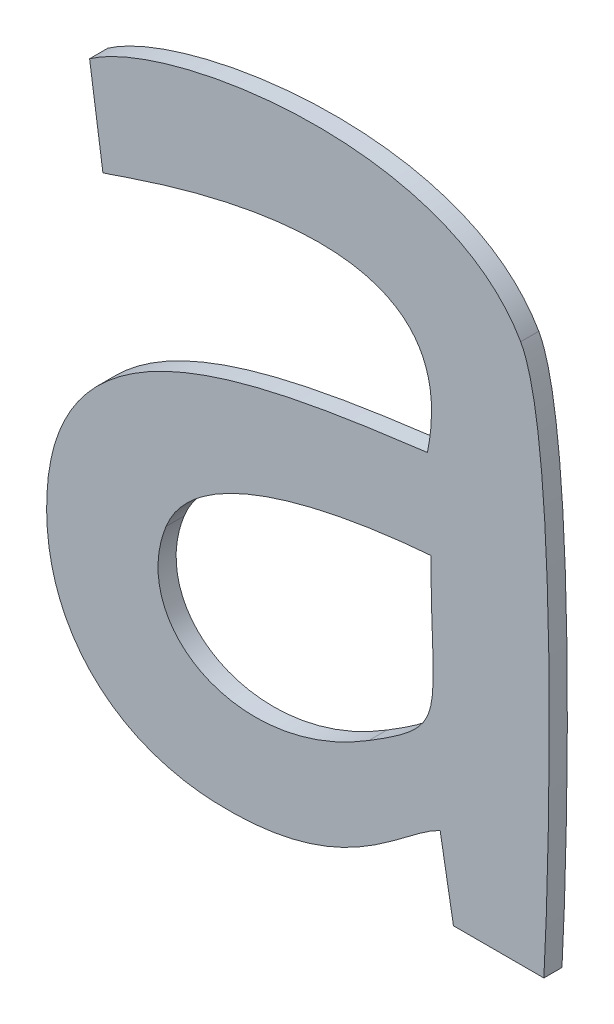
ISO-10303-21;
HEADER;
FILE_DESCRIPTION(('STEP AP214'),'2;1');
FILE_NAME('part.step','',(''),(''),'','','');
FILE_SCHEMA(('AUTOMOTIVE_DESIGN { 1 0 10303 214 1 1 1 1 }'));
ENDSEC;
DATA;
#1=APPLICATION_CONTEXT('core data for automotive mechanical design processes');
#2=APPLICATION_PROTOCOL_DEFINITION('international standard','automotive_design',2000,#1);
#3=PRODUCT_CONTEXT('',#1,'mechanical');
#4=PRODUCT('Part','Part','',(#3));
#5=PRODUCT_RELATED_PRODUCT_CATEGORY('part','',(#4));
#6=PRODUCT_DEFINITION_FORMATION('','',#4);
#7=PRODUCT_DEFINITION_CONTEXT('part definition',#1,'design');
#8=PRODUCT_DEFINITION('design','',#6,#7);
#9=PRODUCT_DEFINITION_SHAPE('','',#8);
#10=(LENGTH_UNIT() NAMED_UNIT(*) SI_UNIT(.MILLI.,.METRE.));
#11=(NAMED_UNIT(*) PLANE_ANGLE_UNIT() SI_UNIT($,.RADIAN.));
#12=(NAMED_UNIT(*) SI_UNIT($,.STERADIAN.) SOLID_ANGLE_UNIT());
#13=UNCERTAINTY_MEASURE_WITH_UNIT(LENGTH_MEASURE(1.E-05),#10,'distance_accuracy_value','');
#14=(GEOMETRIC_REPRESENTATION_CONTEXT(3) GLOBAL_UNCERTAINTY_ASSIGNED_CONTEXT((#13)) GLOBAL_UNIT_ASSIGNED_CONTEXT((#10,
#11,#12)) REPRESENTATION_CONTEXT('',''));
#15=CARTESIAN_POINT('',(0.,0.,0.));
#16=DIRECTION('',(0.,0.,1.));
#17=DIRECTION('',(1.,0.,0.));
#18=AXIS2_PLACEMENT_3D('',#15,#16,#17);
#19=CARTESIAN_POINT('',(-1.9011050390625,-48.580969296875,0.001));
#20=CARTESIAN_POINT('',(-1.9011050390625,-48.580969296875,0.));
#21=CARTESIAN_POINT('',(-1.9007851171875,-48.57540265625,0.001));
#22=CARTESIAN_POINT('',(-1.9007851171875,-48.57540265625,0.));
#23=CARTESIAN_POINT('',(-1.9002732421875,-48.5548956640625,0.001));
#24=CARTESIAN_POINT('',(-1.9002732421875,-48.5548956640625,0.));
#25=CARTESIAN_POINT('',(-1.9023847265625,-48.5511845703125,0.001));
#26=CARTESIAN_POINT('',(-1.9023847265625,-48.5511845703125,0.));
#27=B_SPLINE_SURFACE_WITH_KNOTS('',3,1,((#19,#20),(#21,#22),(#23,#24),(#25,#26)),.UNSPECIFIED.,
.F.,.F.,.F.,(4,4),(2,2),(0.6,0.7),(0.,1.),.UNSPECIFIED.);
#28=CARTESIAN_POINT('',(-1.9011050390625,-48.580969296875,0.));
#29=CARTESIAN_POINT('',(-1.9007851171875,-48.57540265625,0.));
#30=CARTESIAN_POINT('',(-1.9002732421875,-48.5548956640625,0.));
#31=CARTESIAN_POINT('',(-1.9023847265625,-48.5511845703125,0.));
#32=B_SPLINE_CURVE_WITH_KNOTS('',3,(#28,#29,#30,#31),.UNSPECIFIED.,.F.,.F.,(4,4),(0.6,0.7),.UNSPECIFIED.);
#33=CARTESIAN_POINT('',(-1.9011050390625,-48.580969296875,0.));
#34=VERTEX_POINT('',#33);
#35=CARTESIAN_POINT('',(-1.9023847265625,-48.5511845703125,0.));
#36=VERTEX_POINT('',#35);
#37=EDGE_CURVE('E11',#34,#36,#32,.T.);
#38=DIRECTION('',(0.,0.,-1.));
#39=VECTOR('',#38,1.);
#40=CARTESIAN_POINT('',(-1.9023847265625,-48.5511845703125,0.001));
#41=LINE('',#40,#39);
#42=CARTESIAN_POINT('',(-1.9023847265625,-48.5511845703125,0.001));
#43=VERTEX_POINT('',#42);
#44=EDGE_CURVE('E28',#43,#36,#41,.T.);
#45=CARTESIAN_POINT('',(-1.9011050390625,-48.580969296875,0.001));
#46=CARTESIAN_POINT('',(-1.9007851171875,-48.57540265625,0.001));
#47=CARTESIAN_POINT('',(-1.9002732421875,-48.5548956640625,0.001));
#48=CARTESIAN_POINT('',(-1.9023847265625,-48.5511845703125,0.001));
#49=B_SPLINE_CURVE_WITH_KNOTS('',3,(#45,#46,#47,#48),.UNSPECIFIED.,.F.,.F.,(4,4),(0.6,0.7),.UNSPECIFIED.);
#50=CARTESIAN_POINT('',(-1.9011050390625,-48.580969296875,0.001));
#51=VERTEX_POINT('',#50);
#52=EDGE_CURVE('E279',#51,#43,#49,.T.);
#53=DIRECTION('',(0.,0.,-1.));
#54=VECTOR('',#53,1.);
#55=CARTESIAN_POINT('',(-1.9011050390625,-48.580969296875,0.001));
#56=LINE('',#55,#54);
#57=EDGE_CURVE('E40',#51,#34,#56,.T.);
#58=ORIENTED_EDGE('',*,*,#37,.T.);
#59=ORIENTED_EDGE('',*,*,#44,.F.);
#60=ORIENTED_EDGE('',*,*,#52,.F.);
#61=ORIENTED_EDGE('',*,*,#57,.T.);
#62=EDGE_LOOP('',(#58,#59,#60,#61));
#63=FACE_BOUND('',#62,.T.);
#64=ADVANCED_FACE('F17',(#63),#27,.F.);
#65=CARTESIAN_POINT('',(-1.9023847265625,-48.5511845703125,0.001));
#66=CARTESIAN_POINT('',(-1.9023847265625,-48.5511845703125,0.));
#67=CARTESIAN_POINT('',(-1.906447734375,-48.5440503125,0.001));
#68=CARTESIAN_POINT('',(-1.906447734375,-48.5440503125,0.));
#69=CARTESIAN_POINT('',(-1.921676015625,-48.54635375,0.001));
#70=CARTESIAN_POINT('',(-1.921676015625,-48.54635375,0.));
#71=CARTESIAN_POINT('',(-1.9261869140625,-48.54955296875,0.001));
#72=CARTESIAN_POINT('',(-1.9261869140625,-48.54955296875,0.));
#73=B_SPLINE_SURFACE_WITH_KNOTS('',3,1,((#65,#66),(#67,#68),(#69,#70),(#71,#72)),.UNSPECIFIED.,
.F.,.F.,.F.,(4,4),(2,2),(0.7,0.8),(0.,1.),.UNSPECIFIED.);
#74=CARTESIAN_POINT('',(-1.9023847265625,-48.5511845703125,0.));
#75=CARTESIAN_POINT('',(-1.906447734375,-48.5440503125,0.));
#76=CARTESIAN_POINT('',(-1.921676015625,-48.54635375,0.));
#77=CARTESIAN_POINT('',(-1.9261869140625,-48.54955296875,0.));
#78=B_SPLINE_CURVE_WITH_KNOTS('',3,(#74,#75,#76,#77),.UNSPECIFIED.,.F.,.F.,(4,4),(0.7,0.8),.UNSPECIFIED.);
#79=CARTESIAN_POINT('',(-1.9261869140625,-48.54955296875,0.));
#80=VERTEX_POINT('',#79);
#81=EDGE_CURVE('E271',#36,#80,#78,.T.);
#82=DIRECTION('',(0.,0.,-1.));
#83=VECTOR('',#82,1.);
#84=CARTESIAN_POINT('',(-1.9261869140625,-48.54955296875,0.001));
#85=LINE('',#84,#83);
#86=CARTESIAN_POINT('',(-1.9261869140625,-48.54955296875,0.001));
#87=VERTEX_POINT('',#86);
#88=EDGE_CURVE('E266',#87,#80,#85,.T.);
#89=CARTESIAN_POINT('',(-1.9023847265625,-48.5511845703125,0.001));
#90=CARTESIAN_POINT('',(-1.906447734375,-48.5440503125,0.001));
#91=CARTESIAN_POINT('',(-1.921676015625,-48.54635375,0.001));
#92=CARTESIAN_POINT('',(-1.9261869140625,-48.54955296875,0.001));
#93=B_SPLINE_CURVE_WITH_KNOTS('',3,(#89,#90,#91,#92),.UNSPECIFIED.,.F.,.F.,(4,4),(0.7,0.8),.UNSPECIFIED.);
#94=EDGE_CURVE('E262',#43,#87,#93,.T.);
#95=ORIENTED_EDGE('',*,*,#81,.T.);
#96=ORIENTED_EDGE('',*,*,#88,.F.);
#97=ORIENTED_EDGE('',*,*,#94,.F.);
#98=ORIENTED_EDGE('',*,*,#44,.T.);
#99=EDGE_LOOP('',(#95,#96,#97,#98));
#100=FACE_BOUND('',#99,.T.);
#101=ADVANCED_FACE('F289',(#100),#73,.F.);
#102=CARTESIAN_POINT('',(-8.7656585269564,-1.2679883403744,0.001));
#103=DIRECTION('',(0.98969897857415,0.143164003189641,0.));
#104=DIRECTION('',(-0.143164003189641,0.98969897857415,0.));
#105=AXIS2_PLACEMENT_3D('',#102,#103,#104);
#106=PLANE('',#105);
#107=DIRECTION('',(0.143164003189641,-0.98969897857415,0.));
#108=VECTOR('',#107,1.);
#109=CARTESIAN_POINT('',(-8.7656585269564,-1.2679883403744,0.));
#110=LINE('',#109,#108);
#111=CARTESIAN_POINT('',(-1.92545109375,-48.5546397265625,0.));
#112=VERTEX_POINT('',#111);
#113=EDGE_CURVE('E260',#80,#112,#110,.T.);
#114=ORIENTED_EDGE('',*,*,#113,.T.);
#115=DIRECTION('',(0.,0.,-1.));
#116=VECTOR('',#115,1.);
#117=CARTESIAN_POINT('',(-1.92545109375,-48.5546397265625,0.001));
#118=LINE('',#117,#116);
#119=CARTESIAN_POINT('',(-1.92545109375,-48.5546397265625,0.001));
#120=VERTEX_POINT('',#119);
#121=EDGE_CURVE('E257',#120,#112,#118,.T.);
#122=ORIENTED_EDGE('',*,*,#121,.F.);
#123=DIRECTION('',(0.143164003189641,-0.98969897857415,0.));
#124=VECTOR('',#123,1.);
#125=CARTESIAN_POINT('',(-8.7656585269564,-1.2679883403744,0.001));
#126=LINE('',#125,#124);
#127=EDGE_CURVE('E251',#87,#120,#126,.T.);
#128=ORIENTED_EDGE('',*,*,#127,.F.);
#129=ORIENTED_EDGE('',*,*,#88,.T.);
#130=EDGE_LOOP('',(#114,#122,#128,#129));
#131=FACE_BOUND('',#130,.T.);
#132=ADVANCED_FACE('F293',(#131),#106,.F.);
#133=CARTESIAN_POINT('',(-1.92545109375,-48.5546397265625,0.001));
#134=CARTESIAN_POINT('',(-1.92545109375,-48.5546397265625,0.));
#135=CARTESIAN_POINT('',(-1.9245233203125,-48.5544477734375,0.001));
#136=CARTESIAN_POINT('',(-1.9245233203125,-48.5544477734375,0.));
#137=CARTESIAN_POINT('',(-1.90497609375,-48.546545703125,0.001));
#138=CARTESIAN_POINT('',(-1.90497609375,-48.546545703125,0.));
#139=CARTESIAN_POINT('',(-1.90753546875,-48.5590546484375,0.001));
#140=CARTESIAN_POINT('',(-1.90753546875,-48.5590546484375,0.));
#141=B_SPLINE_SURFACE_WITH_KNOTS('',3,1,((#133,#134),(#135,#136),(#137,#138),(#139,#140)),
.UNSPECIFIED.,.F.,.F.,.F.,(4,4),(2,2),(0.,0.1),(0.,1.),.UNSPECIFIED.);
#142=CARTESIAN_POINT('',(-1.92545109375,-48.5546397265625,0.));
#143=CARTESIAN_POINT('',(-1.9245233203125,-48.5544477734375,0.));
#144=CARTESIAN_POINT('',(-1.90497609375,-48.546545703125,0.));
#145=CARTESIAN_POINT('',(-1.90753546875,-48.5590546484375,0.));
#146=B_SPLINE_CURVE_WITH_KNOTS('',3,(#142,#143,#144,#145),.UNSPECIFIED.,.F.,.F.,(4,4),(0.,0.1),.UNSPECIFIED.);
#147=CARTESIAN_POINT('',(-1.90753546875,-48.5590546484375,0.));
#148=VERTEX_POINT('',#147);
#149=EDGE_CURVE('E246',#112,#148,#146,.T.);
#150=DIRECTION('',(0.,0.,-1.));
#151=VECTOR('',#150,1.);
#152=CARTESIAN_POINT('',(-1.90753546875,-48.5590546484375,0.001));
#153=LINE('',#152,#151);
#154=CARTESIAN_POINT('',(-1.90753546875,-48.5590546484375,0.001));
#155=VERTEX_POINT('',#154);
#156=EDGE_CURVE('E241',#155,#148,#153,.T.);
#157=CARTESIAN_POINT('',(-1.92545109375,-48.5546397265625,0.001));
#158=CARTESIAN_POINT('',(-1.9245233203125,-48.5544477734375,0.001));
#159=CARTESIAN_POINT('',(-1.90497609375,-48.546545703125,0.001));
#160=CARTESIAN_POINT('',(-1.90753546875,-48.5590546484375,0.001));
#161=B_SPLINE_CURVE_WITH_KNOTS('',3,(#157,#158,#159,#160),.UNSPECIFIED.,.F.,.F.,(4,4),(0.,0.1),.UNSPECIFIED.);
#162=EDGE_CURVE('E234',#120,#155,#161,.T.);
#163=ORIENTED_EDGE('',*,*,#149,.T.);
#164=ORIENTED_EDGE('',*,*,#156,.F.);
#165=ORIENTED_EDGE('',*,*,#162,.F.);
#166=ORIENTED_EDGE('',*,*,#121,.T.);
#167=EDGE_LOOP('',(#163,#164,#165,#166));
#168=FACE_BOUND('',#167,.T.);
#169=ADVANCED_FACE('F297',(#168),#141,.F.);
#170=CARTESIAN_POINT('',(-1.90753546875,-48.5590546484375,0.001));
#171=CARTESIAN_POINT('',(-1.90753546875,-48.5590546484375,0.));
#172=CARTESIAN_POINT('',(-1.9174850390625,-48.5603343359375,0.001));
#173=CARTESIAN_POINT('',(-1.9174850390625,-48.5603343359375,0.));
#174=CARTESIAN_POINT('',(-1.92929015625,-48.5620619140625,0.001));
#175=CARTESIAN_POINT('',(-1.92929015625,-48.5620619140625,0.));
#176=CARTESIAN_POINT('',(-1.92852234375,-48.5731951953125,0.001));
#177=CARTESIAN_POINT('',(-1.92852234375,-48.5731951953125,0.));
#178=B_SPLINE_SURFACE_WITH_KNOTS('',3,1,((#170,#171),(#172,#173),(#174,#175),(#176,#177)),
.UNSPECIFIED.,.F.,.F.,.F.,(4,4),(2,2),(0.1,0.2),(0.,1.),.UNSPECIFIED.);
#179=CARTESIAN_POINT('',(-1.90753546875,-48.5590546484375,0.));
#180=CARTESIAN_POINT('',(-1.9174850390625,-48.5603343359375,0.));
#181=CARTESIAN_POINT('',(-1.92929015625,-48.5620619140625,0.));
#182=CARTESIAN_POINT('',(-1.92852234375,-48.5731951953125,0.));
#183=B_SPLINE_CURVE_WITH_KNOTS('',3,(#179,#180,#181,#182),.UNSPECIFIED.,.F.,.F.,(4,4),(0.1,0.2),.UNSPECIFIED.);
#184=CARTESIAN_POINT('',(-1.92852234375,-48.5731951953125,0.));
#185=VERTEX_POINT('',#184);
#186=EDGE_CURVE('E229',#148,#185,#183,.T.);
#187=DIRECTION('',(0.,0.,-1.));
#188=VECTOR('',#187,1.);
#189=CARTESIAN_POINT('',(-1.92852234375,-48.5731951953125,0.001));
#190=LINE('',#189,#188);
#191=CARTESIAN_POINT('',(-1.92852234375,-48.5731951953125,0.001));
#192=VERTEX_POINT('',#191);
#193=EDGE_CURVE('E224',#192,#185,#190,.T.);
#194=CARTESIAN_POINT('',(-1.90753546875,-48.5590546484375,0.001));
#195=CARTESIAN_POINT('',(-1.9174850390625,-48.5603343359375,0.001));
#196=CARTESIAN_POINT('',(-1.92929015625,-48.5620619140625,0.001));
#197=CARTESIAN_POINT('',(-1.92852234375,-48.5731951953125,0.001));
#198=B_SPLINE_CURVE_WITH_KNOTS('',3,(#194,#195,#196,#197),.UNSPECIFIED.,.F.,.F.,(4,4),(0.1,0.2),.UNSPECIFIED.);
#199=EDGE_CURVE('E217',#155,#192,#198,.T.);
#200=ORIENTED_EDGE('',*,*,#186,.T.);
#201=ORIENTED_EDGE('',*,*,#193,.F.);
#202=ORIENTED_EDGE('',*,*,#199,.F.);
#203=ORIENTED_EDGE('',*,*,#156,.T.);
#204=EDGE_LOOP('',(#200,#201,#202,#203));
#205=FACE_BOUND('',#204,.T.);
#206=ADVANCED_FACE('F303',(#205),#178,.F.);
#207=CARTESIAN_POINT('',(-1.92852234375,-48.5731951953125,0.001));
#208=CARTESIAN_POINT('',(-1.92852234375,-48.5731951953125,0.));
#209=CARTESIAN_POINT('',(-1.9281384375,-48.5783139453125,0.001));
#210=CARTESIAN_POINT('',(-1.9281384375,-48.5783139453125,0.));
#211=CARTESIAN_POINT('',(-1.9244593359375,-48.5814171875,0.001));
#212=CARTESIAN_POINT('',(-1.9244593359375,-48.5814171875,0.));
#213=CARTESIAN_POINT('',(-1.91930859375,-48.5816411328125,0.001));
#214=CARTESIAN_POINT('',(-1.91930859375,-48.5816411328125,0.));
#215=B_SPLINE_SURFACE_WITH_KNOTS('',3,1,((#207,#208),(#209,#210),(#211,#212),(#213,#214)),
.UNSPECIFIED.,.F.,.F.,.F.,(4,4),(2,2),(0.2,0.3),(0.,1.),.UNSPECIFIED.);
#216=CARTESIAN_POINT('',(-1.92852234375,-48.5731951953125,0.));
#217=CARTESIAN_POINT('',(-1.9281384375,-48.5783139453125,0.));
#218=CARTESIAN_POINT('',(-1.9244593359375,-48.5814171875,0.));
#219=CARTESIAN_POINT('',(-1.91930859375,-48.5816411328125,0.));
#220=B_SPLINE_CURVE_WITH_KNOTS('',3,(#216,#217,#218,#219),.UNSPECIFIED.,.F.,.F.,(4,4),(0.2,0.3),.UNSPECIFIED.);
#221=CARTESIAN_POINT('',(-1.91930859375,-48.5816411328125,0.));
#222=VERTEX_POINT('',#221);
#223=EDGE_CURVE('E212',#185,#222,#220,.T.);
#224=DIRECTION('',(0.,0.,-1.));
#225=VECTOR('',#224,1.);
#226=CARTESIAN_POINT('',(-1.91930859375,-48.5816411328125,0.001));
#227=LINE('',#226,#225);
#228=CARTESIAN_POINT('',(-1.91930859375,-48.5816411328125,0.001));
#229=VERTEX_POINT('',#228);
#230=EDGE_CURVE('E207',#229,#222,#227,.T.);
#231=CARTESIAN_POINT('',(-1.92852234375,-48.5731951953125,0.001));
#232=CARTESIAN_POINT('',(-1.9281384375,-48.5783139453125,0.001));
#233=CARTESIAN_POINT('',(-1.9244593359375,-48.5814171875,0.001));
#234=CARTESIAN_POINT('',(-1.91930859375,-48.5816411328125,0.001));
#235=B_SPLINE_CURVE_WITH_KNOTS('',3,(#231,#232,#233,#234),.UNSPECIFIED.,.F.,.F.,(4,4),(0.2,0.3),.UNSPECIFIED.);
#236=EDGE_CURVE('E200',#192,#229,#235,.T.);
#237=ORIENTED_EDGE('',*,*,#223,.T.);
#238=ORIENTED_EDGE('',*,*,#230,.F.);
#239=ORIENTED_EDGE('',*,*,#236,.F.);
#240=ORIENTED_EDGE('',*,*,#193,.T.);
#241=EDGE_LOOP('',(#237,#238,#239,#240));
#242=FACE_BOUND('',#241,.T.);
#243=ADVANCED_FACE('F309',(#242),#215,.F.);
#244=CARTESIAN_POINT('',(-1.91930859375,-48.5816411328125,0.001));
#245=CARTESIAN_POINT('',(-1.91930859375,-48.5816411328125,0.));
#246=CARTESIAN_POINT('',(-1.912014375,-48.5819610546875,0.001));
#247=CARTESIAN_POINT('',(-1.912014375,-48.5819610546875,0.));
#248=CARTESIAN_POINT('',(-1.90907109375,-48.5778340625,0.001));
#249=CARTESIAN_POINT('',(-1.90907109375,-48.5778340625,0.));
#250=CARTESIAN_POINT('',(-1.906831640625,-48.5767783203125,0.001));
#251=CARTESIAN_POINT('',(-1.906831640625,-48.5767783203125,0.));
#252=B_SPLINE_SURFACE_WITH_KNOTS('',3,1,((#244,#245),(#246,#247),(#248,#249),(#250,#251)),
.UNSPECIFIED.,.F.,.F.,.F.,(4,4),(2,2),(0.3,0.4),(0.,1.),.UNSPECIFIED.);
#253=CARTESIAN_POINT('',(-1.91930859375,-48.5816411328125,0.));
#254=CARTESIAN_POINT('',(-1.912014375,-48.5819610546875,0.));
#255=CARTESIAN_POINT('',(-1.90907109375,-48.5778340625,0.));
#256=CARTESIAN_POINT('',(-1.906831640625,-48.5767783203125,0.));
#257=B_SPLINE_CURVE_WITH_KNOTS('',3,(#253,#254,#255,#256),.UNSPECIFIED.,.F.,.F.,(4,4),(0.3,0.4),.UNSPECIFIED.);
#258=CARTESIAN_POINT('',(-1.906831640625,-48.5767783203125,0.));
#259=VERTEX_POINT('',#258);
#260=EDGE_CURVE('E195',#222,#259,#257,.T.);
#261=DIRECTION('',(0.,0.,-1.));
#262=VECTOR('',#261,1.);
#263=CARTESIAN_POINT('',(-1.906831640625,-48.5767783203125,0.001));
#264=LINE('',#263,#262);
#265=CARTESIAN_POINT('',(-1.906831640625,-48.5767783203125,0.001));
#266=VERTEX_POINT('',#265);
#267=EDGE_CURVE('E190',#266,#259,#264,.T.);
#268=CARTESIAN_POINT('',(-1.91930859375,-48.5816411328125,0.001));
#269=CARTESIAN_POINT('',(-1.912014375,-48.5819610546875,0.001));
#270=CARTESIAN_POINT('',(-1.90907109375,-48.5778340625,0.001));
#271=CARTESIAN_POINT('',(-1.906831640625,-48.5767783203125,0.001));
#272=B_SPLINE_CURVE_WITH_KNOTS('',3,(#268,#269,#270,#271),.UNSPECIFIED.,.F.,.F.,(4,4),(0.3,0.4),.UNSPECIFIED.);
#273=EDGE_CURVE('E186',#229,#266,#272,.T.);
#274=ORIENTED_EDGE('',*,*,#260,.T.);
#275=ORIENTED_EDGE('',*,*,#267,.F.);
#276=ORIENTED_EDGE('',*,*,#273,.F.);
#277=ORIENTED_EDGE('',*,*,#230,.T.);
#278=EDGE_LOOP('',(#274,#275,#276,#277));
#279=FACE_BOUND('',#278,.T.);
#280=ADVANCED_FACE('F313',(#279),#252,.F.);
#281=CARTESIAN_POINT('',(-10.1235144637595,-1.7774109363858,0.001));
#282=DIRECTION('',(0.984934566096257,0.172927442902445,0.));
#283=DIRECTION('',(-0.172927442902445,0.984934566096257,0.));
#284=AXIS2_PLACEMENT_3D('',#281,#282,#283);
#285=PLANE('',#284);
#286=DIRECTION('',(0.172927442902445,-0.984934566096257,0.));
#287=VECTOR('',#286,1.);
#288=CARTESIAN_POINT('',(-10.1235144637595,-1.7774109363858,0.));
#289=LINE('',#288,#287);
#290=CARTESIAN_POINT('',(-1.9060958203125,-48.580969296875,0.));
#291=VERTEX_POINT('',#290);
#292=EDGE_CURVE('E184',#259,#291,#289,.T.);
#293=ORIENTED_EDGE('',*,*,#292,.T.);
#294=DIRECTION('',(0.,0.,-1.));
#295=VECTOR('',#294,1.);
#296=CARTESIAN_POINT('',(-1.9060958203125,-48.580969296875,0.001));
#297=LINE('',#296,#295);
#298=CARTESIAN_POINT('',(-1.9060958203125,-48.580969296875,0.001));
#299=VERTEX_POINT('',#298);
#300=EDGE_CURVE('E181',#299,#291,#297,.T.);
#301=ORIENTED_EDGE('',*,*,#300,.F.);
#302=DIRECTION('',(0.172927442902445,-0.984934566096257,0.));
#303=VECTOR('',#302,1.);
#304=CARTESIAN_POINT('',(-10.1235144637595,-1.7774109363858,0.001));
#305=LINE('',#304,#303);
#306=EDGE_CURVE('E175',#266,#299,#305,.T.);
#307=ORIENTED_EDGE('',*,*,#306,.F.);
#308=ORIENTED_EDGE('',*,*,#267,.T.);
#309=EDGE_LOOP('',(#293,#301,#307,#308));
#310=FACE_BOUND('',#309,.T.);
#311=ADVANCED_FACE('F317',(#310),#285,.F.);
#312=CARTESIAN_POINT('',(-1.9107666796875,-48.574442890625,0.001));
#313=CARTESIAN_POINT('',(-1.9107666796875,-48.574442890625,0.));
#314=CARTESIAN_POINT('',(-1.91802890625,-48.5789537890625,0.001));
#315=CARTESIAN_POINT('',(-1.91802890625,-48.5789537890625,0.));
#316=CARTESIAN_POINT('',(-1.9241394140625,-48.5752426953125,0.001));
#317=CARTESIAN_POINT('',(-1.9241394140625,-48.5752426953125,0.));
#318=CARTESIAN_POINT('',(-1.9219639453125,-48.5698040234375,0.001));
#319=CARTESIAN_POINT('',(-1.9219639453125,-48.5698040234375,0.));
#320=B_SPLINE_SURFACE_WITH_KNOTS('',3,1,((#312,#313),(#314,#315),(#316,#317),(#318,#319)),
.UNSPECIFIED.,.F.,.F.,.F.,(4,4),(2,2),(0.25,0.5),(0.,1.),.UNSPECIFIED.);
#321=CARTESIAN_POINT('',(-1.9107666796875,-48.574442890625,0.));
#322=CARTESIAN_POINT('',(-1.91802890625,-48.5789537890625,0.));
#323=CARTESIAN_POINT('',(-1.9241394140625,-48.5752426953125,0.));
#324=CARTESIAN_POINT('',(-1.9219639453125,-48.5698040234375,0.));
#325=B_SPLINE_CURVE_WITH_KNOTS('',3,(#321,#322,#323,#324),.UNSPECIFIED.,.F.,.F.,(4,4),(0.25,
0.5),.UNSPECIFIED.);
#326=CARTESIAN_POINT('',(-1.9107666796875,-48.574442890625,0.));
#327=VERTEX_POINT('',#326);
#328=CARTESIAN_POINT('',(-1.9219639453125,-48.5698040234375,0.));
#329=VERTEX_POINT('',#328);
#330=EDGE_CURVE('E170',#327,#329,#325,.T.);
#331=DIRECTION('',(0.,0.,-1.));
#332=VECTOR('',#331,1.);
#333=CARTESIAN_POINT('',(-1.9219639453125,-48.5698040234375,0.001));
#334=LINE('',#333,#332);
#335=CARTESIAN_POINT('',(-1.9219639453125,-48.5698040234375,0.001));
#336=VERTEX_POINT('',#335);
#337=EDGE_CURVE('E165',#336,#329,#334,.T.);
#338=CARTESIAN_POINT('',(-1.9107666796875,-48.574442890625,0.001));
#339=CARTESIAN_POINT('',(-1.91802890625,-48.5789537890625,0.001));
#340=CARTESIAN_POINT('',(-1.9241394140625,-48.5752426953125,0.001));
#341=CARTESIAN_POINT('',(-1.9219639453125,-48.5698040234375,0.001));
#342=B_SPLINE_CURVE_WITH_KNOTS('',3,(#338,#339,#340,#341),.UNSPECIFIED.,.F.,.F.,(4,4),(0.25,
0.5),.UNSPECIFIED.);
#343=CARTESIAN_POINT('',(-1.9107666796875,-48.574442890625,0.001));
#344=VERTEX_POINT('',#343);
#345=EDGE_CURVE('E116',#344,#336,#342,.T.);
#346=DIRECTION('',(0.,0.,-1.));
#347=VECTOR('',#346,1.);
#348=CARTESIAN_POINT('',(-1.9107666796875,-48.574442890625,0.001));
#349=LINE('',#348,#347);
#350=EDGE_CURVE('E131',#344,#327,#349,.T.);
#351=ORIENTED_EDGE('',*,*,#330,.T.);
#352=ORIENTED_EDGE('',*,*,#337,.F.);
#353=ORIENTED_EDGE('',*,*,#345,.F.);
#354=ORIENTED_EDGE('',*,*,#350,.T.);
#355=EDGE_LOOP('',(#351,#352,#353,#354));
#356=FACE_BOUND('',#355,.T.);
#357=ADVANCED_FACE('F386',(#356),#320,.F.);
#358=CARTESIAN_POINT('',(-1.9219639453125,-48.5698040234375,0.001));
#359=CARTESIAN_POINT('',(-1.9219639453125,-48.5698040234375,0.));
#360=CARTESIAN_POINT('',(-1.9202363671875,-48.5654530859375,0.001));
#361=CARTESIAN_POINT('',(-1.9202363671875,-48.5654530859375,0.));
#362=CARTESIAN_POINT('',(-1.9115025,-48.564205390625,0.001));
#363=CARTESIAN_POINT('',(-1.9115025,-48.564205390625,0.));
#364=CARTESIAN_POINT('',(-1.907343515625,-48.56388546875,0.001));
#365=CARTESIAN_POINT('',(-1.907343515625,-48.56388546875,0.));
#366=B_SPLINE_SURFACE_WITH_KNOTS('',3,1,((#358,#359),(#360,#361),(#362,#363),(#364,#365)),
.UNSPECIFIED.,.F.,.F.,.F.,(4,4),(2,2),(0.5,1.),(0.,1.),.UNSPECIFIED.);
#367=CARTESIAN_POINT('',(-1.9219639453125,-48.5698040234375,0.));
#368=CARTESIAN_POINT('',(-1.9202363671875,-48.5654530859375,0.));
#369=CARTESIAN_POINT('',(-1.9115025,-48.564205390625,0.));
#370=CARTESIAN_POINT('',(-1.907343515625,-48.56388546875,0.));
#371=B_SPLINE_CURVE_WITH_KNOTS('',3,(#367,#368,#369,#370),.UNSPECIFIED.,.F.,.F.,(4,4),(0.5,1.),.UNSPECIFIED.);
#372=CARTESIAN_POINT('',(-1.907343515625,-48.56388546875,0.));
#373=VERTEX_POINT('',#372);
#374=EDGE_CURVE('E125',#329,#373,#371,.T.);
#375=DIRECTION('',(0.,0.,-1.));
#376=VECTOR('',#375,1.);
#377=CARTESIAN_POINT('',(-1.907343515625,-48.56388546875,0.001));
#378=LINE('',#377,#376);
#379=CARTESIAN_POINT('',(-1.907343515625,-48.56388546875,0.001));
#380=VERTEX_POINT('',#379);
#381=EDGE_CURVE('E119',#380,#373,#378,.T.);
#382=CARTESIAN_POINT('',(-1.9219639453125,-48.5698040234375,0.001));
#383=CARTESIAN_POINT('',(-1.9202363671875,-48.5654530859375,0.001));
#384=CARTESIAN_POINT('',(-1.9115025,-48.564205390625,0.001));
#385=CARTESIAN_POINT('',(-1.907343515625,-48.56388546875,0.001));
#386=B_SPLINE_CURVE_WITH_KNOTS('',3,(#382,#383,#384,#385),.UNSPECIFIED.,.F.,.F.,(4,4),(0.5,1.),.UNSPECIFIED.);
#387=EDGE_CURVE('E109',#336,#380,#386,.T.);
#388=ORIENTED_EDGE('',*,*,#374,.T.);
#389=ORIENTED_EDGE('',*,*,#381,.F.);
#390=ORIENTED_EDGE('',*,*,#387,.F.);
#391=ORIENTED_EDGE('',*,*,#337,.T.);
#392=EDGE_LOOP('',(#388,#389,#390,#391));
#393=FACE_BOUND('',#392,.T.);
#394=ADVANCED_FACE('F123',(#393),#366,.F.);
#395=CARTESIAN_POINT('',(-1.907343515625,-48.56388546875,0.001));
#396=CARTESIAN_POINT('',(-1.907343515625,-48.56388546875,0.));
#397=CARTESIAN_POINT('',(-1.907343515625,-48.5716915625,0.001));
#398=CARTESIAN_POINT('',(-1.907343515625,-48.5716915625,0.));
#399=CARTESIAN_POINT('',(-1.906191796875,-48.571627578125,0.001));
#400=CARTESIAN_POINT('',(-1.906191796875,-48.571627578125,0.));
#401=CARTESIAN_POINT('',(-1.9107666796875,-48.574442890625,0.001));
#402=CARTESIAN_POINT('',(-1.9107666796875,-48.574442890625,0.));
#403=B_SPLINE_SURFACE_WITH_KNOTS('',3,1,((#395,#396),(#397,#398),(#399,#400),(#401,#402)),
.UNSPECIFIED.,.F.,.F.,.F.,(4,4),(2,2),(0.,0.25),(0.,1.),.UNSPECIFIED.);
#404=CARTESIAN_POINT('',(-1.907343515625,-48.56388546875,0.));
#405=CARTESIAN_POINT('',(-1.907343515625,-48.5716915625,0.));
#406=CARTESIAN_POINT('',(-1.906191796875,-48.571627578125,0.));
#407=CARTESIAN_POINT('',(-1.9107666796875,-48.574442890625,0.));
#408=B_SPLINE_CURVE_WITH_KNOTS('',3,(#404,#405,#406,#407),.UNSPECIFIED.,.F.,.F.,(4,4),(0.,0.25),.UNSPECIFIED.);
#409=EDGE_CURVE('E120',#373,#327,#408,.T.);
#410=CARTESIAN_POINT('',(-1.907343515625,-48.56388546875,0.001));
#411=CARTESIAN_POINT('',(-1.907343515625,-48.5716915625,0.001));
#412=CARTESIAN_POINT('',(-1.906191796875,-48.571627578125,0.001));
#413=CARTESIAN_POINT('',(-1.9107666796875,-48.574442890625,0.001));
#414=B_SPLINE_CURVE_WITH_KNOTS('',3,(#410,#411,#412,#413),.UNSPECIFIED.,.F.,.F.,(4,4),(0.,0.25),.UNSPECIFIED.);
#415=EDGE_CURVE('E114',#380,#344,#414,.T.);
#416=ORIENTED_EDGE('',*,*,#409,.T.);
#417=ORIENTED_EDGE('',*,*,#350,.F.);
#418=ORIENTED_EDGE('',*,*,#415,.F.);
#419=ORIENTED_EDGE('',*,*,#381,.T.);
#420=EDGE_LOOP('',(#416,#417,#418,#419));
#421=FACE_BOUND('',#420,.T.);
#422=ADVANCED_FACE('F130',(#421),#403,.F.);
#423=CARTESIAN_POINT('',(0.,-48.580969296875,0.001));
#424=DIRECTION('',(0.,1.,0.));
#425=DIRECTION('',(0.,0.,1.));
#426=AXIS2_PLACEMENT_3D('',#423,#424,#425);
#427=PLANE('',#426);
#428=DIRECTION('',(1.,0.,0.));
#429=VECTOR('',#428,1.);
#430=CARTESIAN_POINT('',(0.,-48.580969296875,0.));
#431=LINE('',#430,#429);
#432=EDGE_CURVE('E132',#291,#34,#431,.T.);
#433=ORIENTED_EDGE('',*,*,#432,.T.);
#434=ORIENTED_EDGE('',*,*,#57,.F.);
#435=DIRECTION('',(1.,0.,0.));
#436=VECTOR('',#435,1.);
#437=CARTESIAN_POINT('',(0.,-48.580969296875,0.001));
#438=LINE('',#437,#436);
#439=EDGE_CURVE('E136',#299,#51,#438,.T.);
#440=ORIENTED_EDGE('',*,*,#439,.F.);
#441=ORIENTED_EDGE('',*,*,#300,.T.);
#442=EDGE_LOOP('',(#433,#434,#440,#441));
#443=FACE_BOUND('',#442,.T.);
#444=ADVANCED_FACE('F319',(#443),#427,.F.);
#445=CARTESIAN_POINT('',(0.,0.,0.001));
#446=DIRECTION('',(0.,0.,1.));
#447=DIRECTION('',(1.,0.,0.));
#448=AXIS2_PLACEMENT_3D('',#445,#446,#447);
#449=PLANE('',#448);
#450=ORIENTED_EDGE('',*,*,#345,.T.);
#451=ORIENTED_EDGE('',*,*,#387,.T.);
#452=ORIENTED_EDGE('',*,*,#415,.T.);
#453=EDGE_LOOP('',(#450,#451,#452));
#454=FACE_BOUND('',#453,.T.);
#455=ORIENTED_EDGE('',*,*,#52,.T.);
#456=ORIENTED_EDGE('',*,*,#94,.T.);
#457=ORIENTED_EDGE('',*,*,#127,.T.);
#458=ORIENTED_EDGE('',*,*,#162,.T.);
#459=ORIENTED_EDGE('',*,*,#199,.T.);
#460=ORIENTED_EDGE('',*,*,#236,.T.);
#461=ORIENTED_EDGE('',*,*,#273,.T.);
#462=ORIENTED_EDGE('',*,*,#306,.T.);
#463=ORIENTED_EDGE('',*,*,#439,.T.);
#464=EDGE_LOOP('',(#455,#456,#457,#458,#459,#460,#461,#462,#463));
#465=FACE_BOUND('',#464,.T.);
#466=ADVANCED_FACE('F111',(#454,#465),#449,.T.);
#467=CARTESIAN_POINT('',(0.,0.,0.));
#468=DIRECTION('',(0.,0.,1.));
#469=DIRECTION('',(1.,0.,0.));
#470=AXIS2_PLACEMENT_3D('',#467,#468,#469);
#471=PLANE('',#470);
#472=ORIENTED_EDGE('',*,*,#330,.F.);
#473=ORIENTED_EDGE('',*,*,#409,.F.);
#474=ORIENTED_EDGE('',*,*,#374,.F.);
#475=EDGE_LOOP('',(#472,#473,#474));
#476=FACE_BOUND('',#475,.T.);
#477=ORIENTED_EDGE('',*,*,#37,.F.);
#478=ORIENTED_EDGE('',*,*,#432,.F.);
#479=ORIENTED_EDGE('',*,*,#292,.F.);
#480=ORIENTED_EDGE('',*,*,#260,.F.);
#481=ORIENTED_EDGE('',*,*,#223,.F.);
#482=ORIENTED_EDGE('',*,*,#186,.F.);
#483=ORIENTED_EDGE('',*,*,#149,.F.);
#484=ORIENTED_EDGE('',*,*,#113,.F.);
#485=ORIENTED_EDGE('',*,*,#81,.F.);
#486=EDGE_LOOP('',(#477,#478,#479,#480,#481,#482,#483,#484,#485));
#487=FACE_BOUND('',#486,.T.);
#488=ADVANCED_FACE('F322',(#476,#487),#471,.F.);
#489=CLOSED_SHELL('',(#64,#101,#132,#169,#206,#243,#280,#311,#357,#394,#422,#444,#466,#488));
#490=MANIFOLD_SOLID_BREP('B1',#489);
#491=ADVANCED_BREP_SHAPE_REPRESENTATION('',(#18,#490),#14);
#492=SHAPE_DEFINITION_REPRESENTATION(#9,#491);
ENDSEC;
END-ISO-10303-21;
